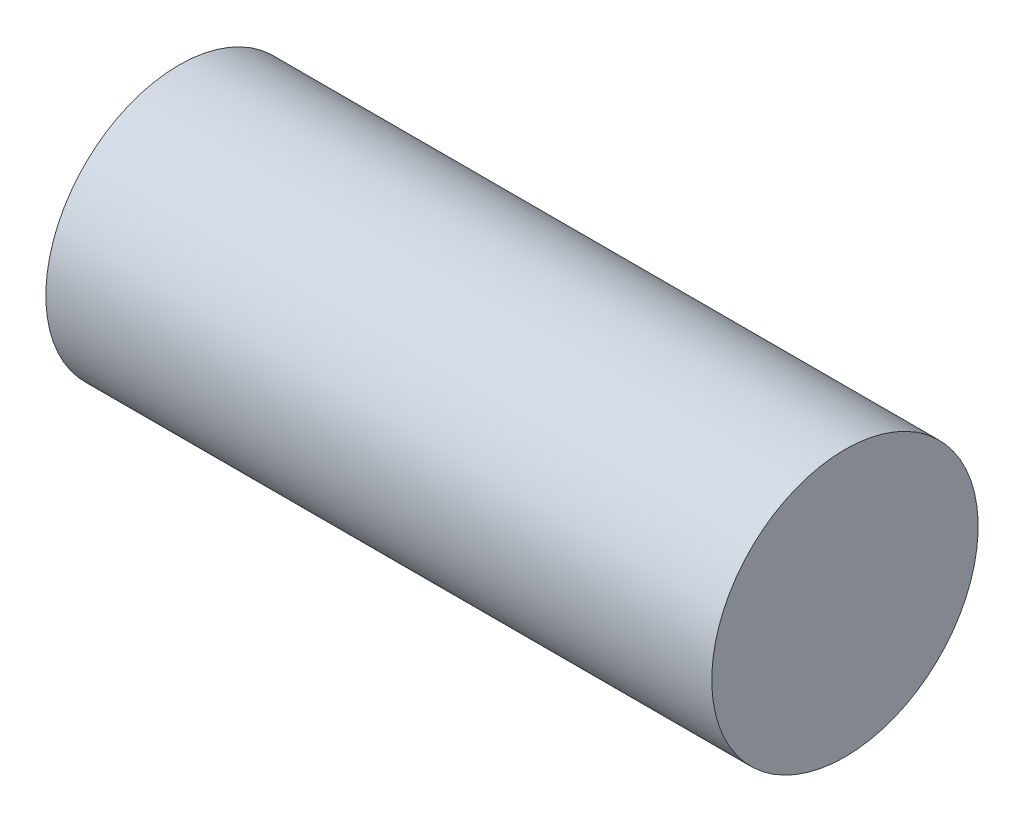
ISO-10303-21;
HEADER;
FILE_DESCRIPTION(('STEP AP214'),'2;1');
FILE_NAME('part.step','',(''),(''),'','','');
FILE_SCHEMA(('AUTOMOTIVE_DESIGN { 1 0 10303 214 1 1 1 1 }'));
ENDSEC;
DATA;
#1=APPLICATION_CONTEXT('core data for automotive mechanical design processes');
#2=APPLICATION_PROTOCOL_DEFINITION('international standard','automotive_design',2000,#1);
#3=PRODUCT_CONTEXT('',#1,'mechanical');
#4=PRODUCT('Part','Part','',(#3));
#5=PRODUCT_RELATED_PRODUCT_CATEGORY('part','',(#4));
#6=PRODUCT_DEFINITION_FORMATION('','',#4);
#7=PRODUCT_DEFINITION_CONTEXT('part definition',#1,'design');
#8=PRODUCT_DEFINITION('design','',#6,#7);
#9=PRODUCT_DEFINITION_SHAPE('','',#8);
#10=(LENGTH_UNIT() NAMED_UNIT(*) SI_UNIT(.MILLI.,.METRE.));
#11=(NAMED_UNIT(*) PLANE_ANGLE_UNIT() SI_UNIT($,.RADIAN.));
#12=(NAMED_UNIT(*) SI_UNIT($,.STERADIAN.) SOLID_ANGLE_UNIT());
#13=UNCERTAINTY_MEASURE_WITH_UNIT(LENGTH_MEASURE(1.E-05),#10,'distance_accuracy_value','');
#14=(GEOMETRIC_REPRESENTATION_CONTEXT(3) GLOBAL_UNCERTAINTY_ASSIGNED_CONTEXT((#13)) GLOBAL_UNIT_ASSIGNED_CONTEXT((#10,
#11,#12)) REPRESENTATION_CONTEXT('',''));
#15=CARTESIAN_POINT('',(0.,0.,0.));
#16=DIRECTION('',(0.,0.,1.));
#17=DIRECTION('',(1.,0.,0.));
#18=AXIS2_PLACEMENT_3D('',#15,#16,#17);
#19=CARTESIAN_POINT('',(-75.,-5.,0.));
#20=DIRECTION('',(1.,0.,0.));
#21=DIRECTION('',(0.,1.,0.));
#22=AXIS2_PLACEMENT_3D('',#19,#20,#21);
#23=PLANE('',#22);
#24=CARTESIAN_POINT('',(-75.,-5.,0.));
#25=DIRECTION('',(1.,0.,0.));
#26=DIRECTION('',(0.,1.,0.));
#27=AXIS2_PLACEMENT_3D('',#24,#25,#26);
#28=CIRCLE('',#27,30.);
#29=CARTESIAN_POINT('',(-75.,25.,0.));
#30=VERTEX_POINT('',#29);
#31=EDGE_CURVE('E53',#30,#30,#28,.T.);
#32=ORIENTED_EDGE('',*,*,#31,.F.);
#33=EDGE_LOOP('',(#32));
#34=FACE_BOUND('',#33,.T.);
#35=ADVANCED_FACE('F45',(#34),#23,.F.);
#36=CARTESIAN_POINT('',(75.,-4.99999999999997,0.));
#37=DIRECTION('',(1.,0.,0.));
#38=DIRECTION('',(0.,1.,0.));
#39=AXIS2_PLACEMENT_3D('',#36,#37,#38);
#40=PLANE('',#39);
#41=CARTESIAN_POINT('',(75.,-4.99999999999997,0.));
#42=DIRECTION('',(1.,0.,0.));
#43=DIRECTION('',(0.,1.,0.));
#44=AXIS2_PLACEMENT_3D('',#41,#42,#43);
#45=CIRCLE('',#44,30.);
#46=CARTESIAN_POINT('',(75.,25.,0.));
#47=VERTEX_POINT('',#46);
#48=EDGE_CURVE('E12',#47,#47,#45,.T.);
#49=ORIENTED_EDGE('',*,*,#48,.T.);
#50=EDGE_LOOP('',(#49));
#51=FACE_BOUND('',#50,.T.);
#52=ADVANCED_FACE('F60',(#51),#40,.T.);
#53=CARTESIAN_POINT('',(-75.,-5.,0.));
#54=DIRECTION('',(1.,0.,0.));
#55=DIRECTION('',(0.,1.,0.));
#56=AXIS2_PLACEMENT_3D('',#53,#54,#55);
#57=CYLINDRICAL_SURFACE('',#56,30.);
#58=ORIENTED_EDGE('',*,*,#48,.F.);
#59=EDGE_LOOP('',(#58));
#60=FACE_BOUND('',#59,.T.);
#61=ORIENTED_EDGE('',*,*,#31,.T.);
#62=EDGE_LOOP('',(#61));
#63=FACE_BOUND('',#62,.T.);
#64=ADVANCED_FACE('F62',(#60,#63),#57,.T.);
#65=CLOSED_SHELL('',(#35,#52,#64));
#66=MANIFOLD_SOLID_BREP('B2',#65);
#67=ADVANCED_BREP_SHAPE_REPRESENTATION('',(#18,#66),#14);
#68=SHAPE_DEFINITION_REPRESENTATION(#9,#67);
ENDSEC;
END-ISO-10303-21;
